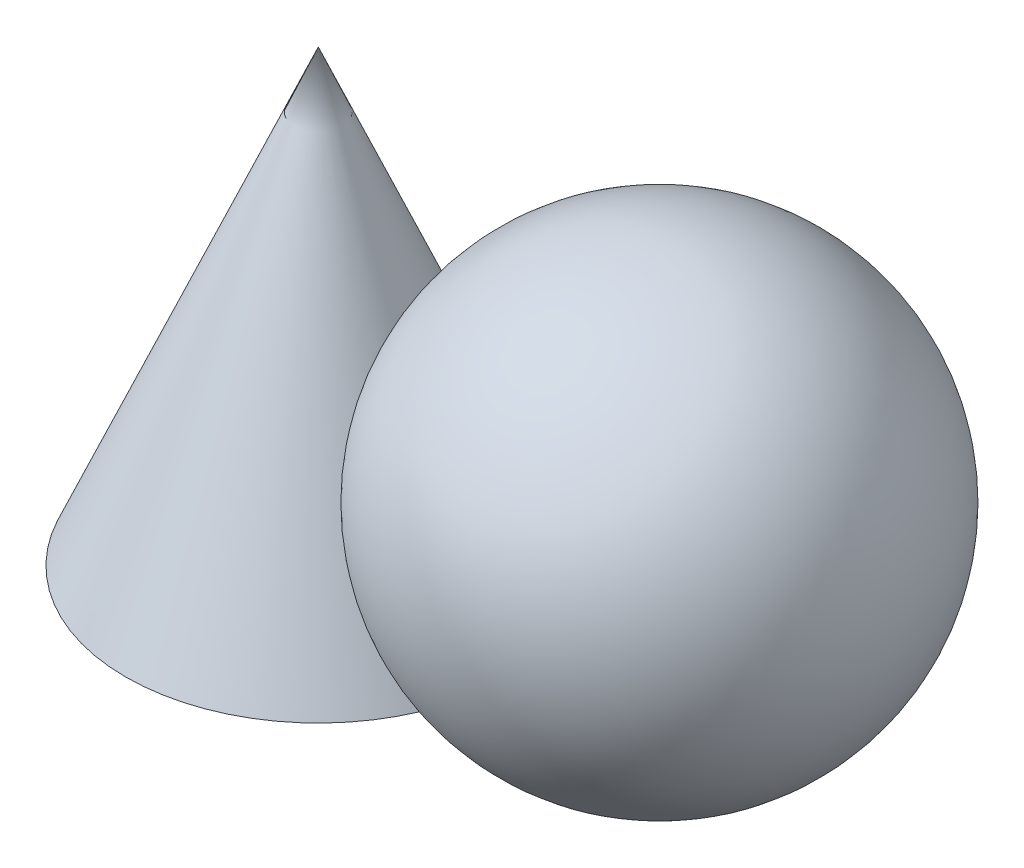
ISO-10303-21;
HEADER;
FILE_DESCRIPTION(('STEP AP214'),'2;1');
FILE_NAME('part.step','',(''),(''),'','','');
FILE_SCHEMA(('AUTOMOTIVE_DESIGN { 1 0 10303 214 1 1 1 1 }'));
ENDSEC;
DATA;
#1=APPLICATION_CONTEXT('core data for automotive mechanical design processes');
#2=APPLICATION_PROTOCOL_DEFINITION('international standard','automotive_design',2000,#1);
#3=PRODUCT_CONTEXT('',#1,'mechanical');
#4=PRODUCT('Part','Part','',(#3));
#5=PRODUCT_RELATED_PRODUCT_CATEGORY('part','',(#4));
#6=PRODUCT_DEFINITION_FORMATION('','',#4);
#7=PRODUCT_DEFINITION_CONTEXT('part definition',#1,'design');
#8=PRODUCT_DEFINITION('design','',#6,#7);
#9=PRODUCT_DEFINITION_SHAPE('','',#8);
#10=(LENGTH_UNIT() NAMED_UNIT(*) SI_UNIT(.MILLI.,.METRE.));
#11=(NAMED_UNIT(*) PLANE_ANGLE_UNIT() SI_UNIT($,.RADIAN.));
#12=(NAMED_UNIT(*) SI_UNIT($,.STERADIAN.) SOLID_ANGLE_UNIT());
#13=UNCERTAINTY_MEASURE_WITH_UNIT(LENGTH_MEASURE(1.E-05),#10,'distance_accuracy_value','');
#14=(GEOMETRIC_REPRESENTATION_CONTEXT(3) GLOBAL_UNCERTAINTY_ASSIGNED_CONTEXT((#13)) GLOBAL_UNIT_ASSIGNED_CONTEXT((#10,
#11,#12)) REPRESENTATION_CONTEXT('',''));
#15=CARTESIAN_POINT('',(0.,0.,0.));
#16=DIRECTION('',(0.,0.,1.));
#17=DIRECTION('',(1.,0.,0.));
#18=AXIS2_PLACEMENT_3D('',#15,#16,#17);
#19=CARTESIAN_POINT('',(0.,0.,0.));
#20=DIRECTION('',(0.,1.,0.));
#21=DIRECTION('',(0.,0.,1.));
#22=AXIS2_PLACEMENT_3D('',#19,#20,#21);
#23=PLANE('',#22);
#24=CARTESIAN_POINT('',(0.,0.,0.));
#25=DIRECTION('',(0.,1.,0.));
#26=DIRECTION('',(0.,0.,1.));
#27=AXIS2_PLACEMENT_3D('',#24,#25,#26);
#28=CIRCLE('',#27,30.);
#29=CARTESIAN_POINT('',(0.,0.,30.));
#30=VERTEX_POINT('',#29);
#31=EDGE_CURVE('E47',#30,#30,#28,.T.);
#32=ORIENTED_EDGE('',*,*,#31,.F.);
#33=EDGE_LOOP('',(#32));
#34=FACE_BOUND('',#33,.T.);
#35=ADVANCED_FACE('F36',(#34),#23,.F.);
#36=CARTESIAN_POINT('',(0.,70.,0.));
#37=DIRECTION('',(0.,-1.,0.));
#38=DIRECTION('',(0.,0.,-1.));
#39=AXIS2_PLACEMENT_3D('',#36,#37,#38);
#40=CONICAL_SURFACE('',#39,0.,0.404891786285083);
#41=CARTESIAN_POINT('',(20.7700598542307,21.5365270067951,0.));
#42=CARTESIAN_POINT('',(20.7700601605581,21.5365262786052,0.00676954428108188));
#43=CARTESIAN_POINT('',(20.7702960631902,21.5359680335004,0.0135460749122196));
#44=CARTESIAN_POINT('',(20.7712201668685,21.5337814956177,0.0268961872450828));
#45=CARTESIAN_POINT('',(20.7719091101649,21.5321514468247,0.0334694173281835));
#46=CARTESIAN_POINT('',(20.7736800227953,21.5279623203538,0.0462036014776122));
#47=CARTESIAN_POINT('',(20.7747594061648,21.5254093554043,0.0523669593973787));
#48=CARTESIAN_POINT('',(20.7772457143878,21.5195302892965,0.0642353751715037));
#49=CARTESIAN_POINT('',(20.7786527057981,21.5162040310363,0.0699403395815189));
#50=CARTESIAN_POINT('',(20.782631800446,21.5068000807492,0.0840519559010402));
#51=CARTESIAN_POINT('',(20.7854041541621,21.5002507312093,0.0920880992573166));
#52=CARTESIAN_POINT('',(20.7914098259383,21.4860717243432,0.106945291961173));
#53=CARTESIAN_POINT('',(20.7946444303333,21.4784390528055,0.11376282688022));
#54=CARTESIAN_POINT('',(20.80324436095,21.4581595004997,0.129616174910401));
#55=CARTESIAN_POINT('',(20.8088249780486,21.4450118842006,0.137891922692064));
#56=CARTESIAN_POINT('',(20.8204195548299,21.4177264453657,0.152161735492661));
#57=CARTESIAN_POINT('',(20.8264342747445,21.4035868869436,0.158151676196713));
#58=CARTESIAN_POINT('',(20.8415656622869,21.3680571664665,0.170431698274723));
#59=CARTESIAN_POINT('',(20.850831493625,21.3463355378525,0.175581650095455));
#60=CARTESIAN_POINT('',(20.8695992415036,21.3024158788146,0.182066889554068));
#61=CARTESIAN_POINT('',(20.8791015836778,21.2802170010222,0.183394709404535));
#62=CARTESIAN_POINT('',(20.8983132223814,21.2354136016426,0.182316380306117));
#63=CARTESIAN_POINT('',(20.9080224385563,21.212810992606,0.17982683120387));
#64=CARTESIAN_POINT('',(20.9271554667922,21.1683470470567,0.170722104859485));
#65=CARTESIAN_POINT('',(20.9365800713615,21.1464836269778,0.164119760504642));
#66=CARTESIAN_POINT('',(20.950543983574,21.1141410351328,0.150278535060985));
#67=CARTESIAN_POINT('',(20.9553389068331,21.1030453540532,0.144724857794092));
#68=CARTESIAN_POINT('',(20.9646006123753,21.0816305825084,0.132044378234067));
#69=CARTESIAN_POINT('',(20.9690677193853,21.0713107232777,0.12491916148818));
#70=CARTESIAN_POINT('',(20.9765080705762,21.0541343819879,0.110753964928894));
#71=CARTESIAN_POINT('',(20.9795879866267,21.0470286319818,0.104074735482105));
#72=CARTESIAN_POINT('',(20.9853027252305,21.0338503084456,0.0895929415898459));
#73=CARTESIAN_POINT('',(20.9879383148164,21.027775954303,0.0817923569707933));
#74=CARTESIAN_POINT('',(20.9919632044648,21.0185030178877,0.0672841054785664));
#75=CARTESIAN_POINT('',(20.9934977768814,21.0149687224215,0.0608327788566956));
#76=CARTESIAN_POINT('',(20.9961331669646,21.0089003280435,0.0473893430839279));
#77=CARTESIAN_POINT('',(20.9972343428752,21.0063654030531,0.0403976863118783));
#78=CARTESIAN_POINT('',(20.9989221002524,21.0024805696529,0.025960137970694));
#79=CARTESIAN_POINT('',(20.9995041817497,21.0011410237816,0.0185108614595839));
#80=CARTESIAN_POINT('',(21.0000771449872,20.9998224582301,0.00347088409942371));
#81=CARTESIAN_POINT('',(21.0000684046144,20.9998425689193,-0.00411972324876085));
#82=CARTESIAN_POINT('',(20.9995010841717,21.0011481553374,-0.0181898309420965));
#83=CARTESIAN_POINT('',(20.9990124650512,21.0022726275847,-0.0246880272710397));
#84=CARTESIAN_POINT('',(20.9976260485304,21.0054637466409,-0.0374012682224653));
#85=CARTESIAN_POINT('',(20.9967280836213,21.0075307791559,-0.043616195781902));
#86=CARTESIAN_POINT('',(20.9942553664985,21.0132240341946,-0.0574682281709864));
#87=CARTESIAN_POINT('',(20.9925580579255,21.0171327597562,-0.0649668789113363));
#88=CARTESIAN_POINT('',(20.9887042219937,21.0260111985297,-0.0791746395111491));
#89=CARTESIAN_POINT('',(20.9865468280275,21.0309829140133,-0.0858822217774732));
#90=CARTESIAN_POINT('',(20.9808564698069,21.0441022993424,-0.101297809178608));
#91=CARTESIAN_POINT('',(20.9771383089173,21.0526794004087,-0.109569819384336));
#92=CARTESIAN_POINT('',(20.969245690506,21.0708999230117,-0.124564252626695));
#93=CARTESIAN_POINT('',(20.9650703269848,21.0805454622361,-0.131283513710703));
#94=CARTESIAN_POINT('',(20.9540686421717,21.1059811776237,-0.14662144784232));
#95=CARTESIAN_POINT('',(20.9470365262032,21.1222579967951,-0.154282968379483));
#96=CARTESIAN_POINT('',(20.9326086335557,21.1556982188847,-0.166790356675989));
#97=CARTESIAN_POINT('',(20.9252121315227,21.1728633939188,-0.171630340149752));
#98=CARTESIAN_POINT('',(20.9077731606366,21.2133900899354,-0.179967084717447));
#99=CARTESIAN_POINT('',(20.8976641966347,21.2369243744325,-0.1824910861009));
#100=CARTESIAN_POINT('',(20.8774501892897,21.2840713387983,-0.183334104102262));
#101=CARTESIAN_POINT('',(20.8673451476913,21.3076840377593,-0.181652008121889));
#102=CARTESIAN_POINT('',(20.849654381851,21.3490974409935,-0.174785861488396));
#103=CARTESIAN_POINT('',(20.8420100803606,21.3670182819705,-0.170467926863949));
#104=CARTESIAN_POINT('',(20.8270855887806,21.4020539926497,-0.15892845336992));
#105=CARTESIAN_POINT('',(20.819804529137,21.4191707807771,-0.15171426383575));
#106=CARTESIAN_POINT('',(20.80862984572,21.4454736142158,-0.137391961116819));
#107=CARTESIAN_POINT('',(20.8045237049477,21.4551465041634,-0.13134248526715));
#108=CARTESIAN_POINT('',(20.7966819201515,21.4736324888268,-0.117834383350317));
#109=CARTESIAN_POINT('',(20.7929458456095,21.4824465824275,-0.110377424753917));
#110=CARTESIAN_POINT('',(20.786909169156,21.4966968237636,-0.0959973309258541));
#111=CARTESIAN_POINT('',(20.7844845142036,21.5024234600944,-0.089416302280236));
#112=CARTESIAN_POINT('',(20.7800651122384,21.5128653237762,-0.0753587650281633));
#113=CARTESIAN_POINT('',(20.778069807017,21.51758186434,-0.0678834390487527));
#114=CARTESIAN_POINT('',(20.77502848962,21.5247729609966,-0.053825538465455));
#115=CARTESIAN_POINT('',(20.7738703677148,21.5275120944717,-0.0474032666726698));
#116=CARTESIAN_POINT('',(20.7719847565873,21.5319724697167,-0.0341598141144497));
#117=CARTESIAN_POINT('',(20.7712562223441,21.5336961816054,-0.0273396461093449));
#118=CARTESIAN_POINT('',(20.7705358558089,21.5354006571869,-0.0170462598285217));
#119=CARTESIAN_POINT('',(20.7703578331912,21.5358219016838,-0.0136541617246836));
#120=CARTESIAN_POINT('',(20.7701197421393,21.5363852909158,-0.00684197473299361));
#121=CARTESIAN_POINT('',(20.7700596993878,21.5365273748816,-0.00342187991332065));
#122=CARTESIAN_POINT('',(20.7700598542307,21.5365270067951,0.));
#123=B_SPLINE_CURVE_WITH_KNOTS('',3,(#41,#42,#43,#44,#45,#46,#47,#48,#49,#50,#51,#52,#53,#54,
#55,#56,#57,#58,#59,#60,#61,#62,#63,#64,#65,#66,#67,#68,#69,#70,#71,#72,#73,#74,#75,#76,#77,#78,
#79,#80,#81,#82,#83,#84,#85,#86,#87,#88,#89,#90,#91,#92,#93,#94,#95,#96,#97,#98,#99,#100,#101,
#102,#103,#104,#105,#106,#107,#108,#109,#110,#111,#112,#113,#114,#115,#116,#117,#118,#119,#120,
#121,#122),.UNSPECIFIED.,.T.,.F.,(4,2,2,2,2,2,2,2,2,2,2,2,2,2,2,2,2,2,2,2,2,2,2,2,2,2,2,2,2,2,2,
2,2,2,2,2,2,2,2,2,4),(0.,0.0202949904563639,0.0406233148255188,0.0608193944645923,
0.0810195807206244,0.113029827188658,0.145130950897784,0.194377655871315,0.243712801924155,
0.315843402009895,0.38811483751859,0.461987872026449,0.53563155198856,0.575450303924173,
0.615229064473684,0.645816061137424,0.676349703007016,0.698810356449807,0.721252404815051,
0.743887160937764,0.766507440103142,0.786255339857018,0.80601132793238,0.831743147451173,
0.857523869862533,0.894763453975607,0.932078215785556,0.989705727371924,1.04745299451341,
1.12428766710851,1.20114266618684,1.26083132929879,1.32036947838659,1.35665834014581,
1.39290447664625,1.41998200311035,1.44702410979613,1.46817486450726,1.48927395303712,
1.49953046435,1.50978920811474),.UNSPECIFIED.);
#124=CARTESIAN_POINT('',(20.7700598542307,21.5365270067951,0.));
#125=VERTEX_POINT('',#124);
#126=EDGE_CURVE('E12',#125,#125,#123,.T.);
#127=ORIENTED_EDGE('',*,*,#126,.F.);
#128=EDGE_LOOP('',(#127));
#129=FACE_BOUND('',#128,.T.);
#130=ORIENTED_EDGE('',*,*,#31,.T.);
#131=EDGE_LOOP('',(#130));
#132=FACE_BOUND('',#131,.T.);
#133=CARTESIAN_POINT('',(0.,70.,0.));
#134=VERTEX_POINT('',#133);
#135=VERTEX_LOOP('',#134);
#136=FACE_BOUND('',#135,.T.);
#137=ADVANCED_FACE('F38',(#129,#132,#136),#40,.T.);
#138=CARTESIAN_POINT('',(53.1373405657318,35.0906823485197,0.));
#139=DIRECTION('',(0.,1.,0.));
#140=DIRECTION('',(1.,0.,0.));
#141=AXIS2_PLACEMENT_3D('',#138,#139,#140);
#142=SPHERICAL_SURFACE('',#141,35.0906823485197);
#143=ORIENTED_EDGE('',*,*,#126,.T.);
#144=EDGE_LOOP('',(#143));
#145=FACE_BOUND('',#144,.T.);
#146=ADVANCED_FACE('F51',(#145),#142,.T.);
#147=CLOSED_SHELL('',(#35,#137,#146));
#148=MANIFOLD_SOLID_BREP('B2',#147);
#149=ADVANCED_BREP_SHAPE_REPRESENTATION('',(#18,#148),#14);
#150=SHAPE_DEFINITION_REPRESENTATION(#9,#149);
ENDSEC;
END-ISO-10303-21;
